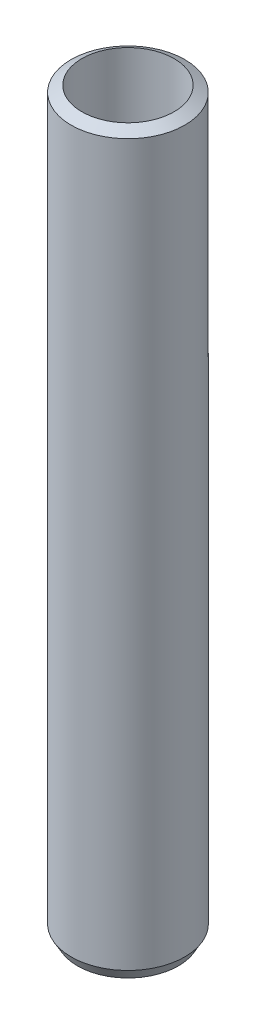
ISO-10303-21;
HEADER;
FILE_DESCRIPTION(('STEP AP214'),'2;1');
FILE_NAME('part.step','',(''),(''),'','','');
FILE_SCHEMA(('AUTOMOTIVE_DESIGN { 1 0 10303 214 1 1 1 1 }'));
ENDSEC;
DATA;
#1=APPLICATION_CONTEXT('core data for automotive mechanical design processes');
#2=APPLICATION_PROTOCOL_DEFINITION('international standard','automotive_design',2000,#1);
#3=PRODUCT_CONTEXT('',#1,'mechanical');
#4=PRODUCT('Part','Part','',(#3));
#5=PRODUCT_RELATED_PRODUCT_CATEGORY('part','',(#4));
#6=PRODUCT_DEFINITION_FORMATION('','',#4);
#7=PRODUCT_DEFINITION_CONTEXT('part definition',#1,'design');
#8=PRODUCT_DEFINITION('design','',#6,#7);
#9=PRODUCT_DEFINITION_SHAPE('','',#8);
#10=(LENGTH_UNIT() NAMED_UNIT(*) SI_UNIT(.MILLI.,.METRE.));
#11=(NAMED_UNIT(*) PLANE_ANGLE_UNIT() SI_UNIT($,.RADIAN.));
#12=(NAMED_UNIT(*) SI_UNIT($,.STERADIAN.) SOLID_ANGLE_UNIT());
#13=UNCERTAINTY_MEASURE_WITH_UNIT(LENGTH_MEASURE(1.E-05),#10,'distance_accuracy_value','');
#14=(GEOMETRIC_REPRESENTATION_CONTEXT(3) GLOBAL_UNCERTAINTY_ASSIGNED_CONTEXT((#13)) GLOBAL_UNIT_ASSIGNED_CONTEXT((#10,
#11,#12)) REPRESENTATION_CONTEXT('',''));
#15=CARTESIAN_POINT('',(0.,0.,0.));
#16=DIRECTION('',(0.,0.,1.));
#17=DIRECTION('',(1.,0.,0.));
#18=AXIS2_PLACEMENT_3D('',#15,#16,#17);
#19=CARTESIAN_POINT('',(0.,454.222885839414,0.));
#20=DIRECTION('',(0.,-1.,0.));
#21=DIRECTION('',(0.,0.,-1.));
#22=AXIS2_PLACEMENT_3D('',#19,#20,#21);
#23=CYLINDRICAL_SURFACE('',#22,35.);
#24=CARTESIAN_POINT('',(0.,450.301609582791,0.));
#25=DIRECTION('',(0.,1.,0.));
#26=DIRECTION('',(0.,0.,1.));
#27=AXIS2_PLACEMENT_3D('',#24,#25,#26);
#28=CIRCLE('',#27,35.);
#29=CARTESIAN_POINT('',(0.,450.301609582791,35.));
#30=VERTEX_POINT('',#29);
#31=EDGE_CURVE('E50',#30,#30,#28,.F.);
#32=ORIENTED_EDGE('',*,*,#31,.T.);
#33=EDGE_LOOP('',(#32));
#34=FACE_BOUND('',#33,.T.);
#35=CARTESIAN_POINT('',(0.,6.79184970698526,0.));
#36=DIRECTION('',(0.,1.,0.));
#37=DIRECTION('',(0.,0.,1.));
#38=AXIS2_PLACEMENT_3D('',#35,#36,#37);
#39=CIRCLE('',#38,35.);
#40=CARTESIAN_POINT('',(0.,6.79184970698526,35.));
#41=VERTEX_POINT('',#40);
#42=EDGE_CURVE('E51',#41,#41,#39,.T.);
#43=ORIENTED_EDGE('',*,*,#42,.T.);
#44=EDGE_LOOP('',(#43));
#45=FACE_BOUND('',#44,.T.);
#46=ADVANCED_FACE('F39',(#34,#45),#23,.T.);
#47=CARTESIAN_POINT('',(0.,0.,0.));
#48=DIRECTION('',(0.,1.,0.));
#49=DIRECTION('',(0.,0.,1.));
#50=AXIS2_PLACEMENT_3D('',#47,#48,#49);
#51=PLANE('',#50);
#52=CARTESIAN_POINT('',(0.,0.,0.));
#53=DIRECTION('',(0.,1.,0.));
#54=DIRECTION('',(0.,0.,1.));
#55=AXIS2_PLACEMENT_3D('',#52,#53,#54);
#56=CIRCLE('',#55,31.0787237433766);
#57=CARTESIAN_POINT('',(0.,0.,31.0787237433766));
#58=VERTEX_POINT('',#57);
#59=EDGE_CURVE('E10',#58,#58,#56,.F.);
#60=ORIENTED_EDGE('',*,*,#59,.T.);
#61=EDGE_LOOP('',(#60));
#62=FACE_BOUND('',#61,.T.);
#63=CARTESIAN_POINT('',(0.,0.,0.));
#64=DIRECTION('',(0.,1.,0.));
#65=DIRECTION('',(0.,0.,1.));
#66=AXIS2_PLACEMENT_3D('',#63,#64,#65);
#67=CIRCLE('',#66,28.3992968130412);
#68=CARTESIAN_POINT('',(0.,0.,28.3992968130412));
#69=VERTEX_POINT('',#68);
#70=EDGE_CURVE('E58',#69,#69,#67,.T.);
#71=ORIENTED_EDGE('',*,*,#70,.T.);
#72=EDGE_LOOP('',(#71));
#73=FACE_BOUND('',#72,.T.);
#74=ADVANCED_FACE('F62',(#62,#73),#51,.F.);
#75=CARTESIAN_POINT('',(0.,454.222885839414,0.));
#76=DIRECTION('',(0.,-1.,0.));
#77=DIRECTION('',(0.,0.,-1.));
#78=AXIS2_PLACEMENT_3D('',#75,#76,#77);
#79=CYLINDRICAL_SURFACE('',#78,28.3992968130412);
#80=CARTESIAN_POINT('',(0.,454.112527344622,0.));
#81=DIRECTION('',(0.,-1.,0.));
#82=DIRECTION('',(0.,0.,-1.));
#83=AXIS2_PLACEMENT_3D('',#80,#81,#82);
#84=CIRCLE('',#83,28.3992968130412);
#85=CARTESIAN_POINT('',(0.,454.112527344622,-28.3992968130412));
#86=VERTEX_POINT('',#85);
#87=EDGE_CURVE('E54',#86,#86,#84,.F.);
#88=ORIENTED_EDGE('',*,*,#87,.T.);
#89=EDGE_LOOP('',(#88));
#90=FACE_BOUND('',#89,.T.);
#91=ORIENTED_EDGE('',*,*,#70,.F.);
#92=EDGE_LOOP('',(#91));
#93=FACE_BOUND('',#92,.T.);
#94=ADVANCED_FACE('F68',(#90,#93),#79,.F.);
#95=CARTESIAN_POINT('',(0.,454.222885839414,0.));
#96=DIRECTION('',(0.,-1.,0.));
#97=DIRECTION('',(0.,0.,-1.));
#98=AXIS2_PLACEMENT_3D('',#95,#96,#97);
#99=CONICAL_SURFACE('',#98,28.2081502930148,1.0471975511966);
#100=ORIENTED_EDGE('',*,*,#31,.F.);
#101=EDGE_LOOP('',(#100));
#102=FACE_BOUND('',#101,.T.);
#103=ORIENTED_EDGE('',*,*,#87,.F.);
#104=EDGE_LOOP('',(#103));
#105=FACE_BOUND('',#104,.T.);
#106=ADVANCED_FACE('F66',(#102,#105),#99,.T.);
#107=CARTESIAN_POINT('',(0.,6.79184970698526,0.));
#108=DIRECTION('',(0.,1.,0.));
#109=DIRECTION('',(0.,0.,1.));
#110=AXIS2_PLACEMENT_3D('',#107,#108,#109);
#111=CONICAL_SURFACE('',#110,35.,0.523598775598302);
#112=ORIENTED_EDGE('',*,*,#59,.F.);
#113=EDGE_LOOP('',(#112));
#114=FACE_BOUND('',#113,.T.);
#115=ORIENTED_EDGE('',*,*,#42,.F.);
#116=EDGE_LOOP('',(#115));
#117=FACE_BOUND('',#116,.T.);
#118=ADVANCED_FACE('F45',(#114,#117),#111,.T.);
#119=CLOSED_SHELL('',(#46,#74,#94,#106,#118));
#120=MANIFOLD_SOLID_BREP('B2',#119);
#121=ADVANCED_BREP_SHAPE_REPRESENTATION('',(#18,#120),#14);
#122=SHAPE_DEFINITION_REPRESENTATION(#9,#121);
ENDSEC;
END-ISO-10303-21;
